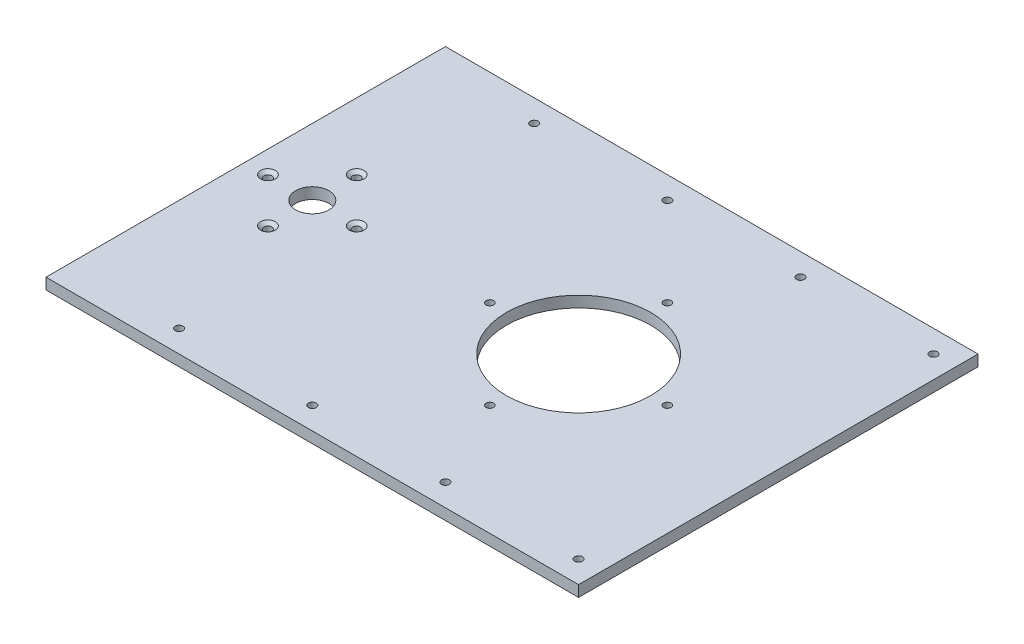
ISO-10303-21;
HEADER;
FILE_DESCRIPTION(('STEP AP214'),'2;1');
FILE_NAME('part.step','',(''),(''),'','','');
FILE_SCHEMA(('AUTOMOTIVE_DESIGN { 1 0 10303 214 1 1 1 1 }'));
ENDSEC;
DATA;
#1=APPLICATION_CONTEXT('core data for automotive mechanical design processes');
#2=APPLICATION_PROTOCOL_DEFINITION('international standard','automotive_design',2000,#1);
#3=PRODUCT_CONTEXT('',#1,'mechanical');
#4=PRODUCT('Part','Part','',(#3));
#5=PRODUCT_RELATED_PRODUCT_CATEGORY('part','',(#4));
#6=PRODUCT_DEFINITION_FORMATION('','',#4);
#7=PRODUCT_DEFINITION_CONTEXT('part definition',#1,'design');
#8=PRODUCT_DEFINITION('design','',#6,#7);
#9=PRODUCT_DEFINITION_SHAPE('','',#8);
#10=(LENGTH_UNIT() NAMED_UNIT(*) SI_UNIT(.MILLI.,.METRE.));
#11=(NAMED_UNIT(*) PLANE_ANGLE_UNIT() SI_UNIT($,.RADIAN.));
#12=(NAMED_UNIT(*) SI_UNIT($,.STERADIAN.) SOLID_ANGLE_UNIT());
#13=UNCERTAINTY_MEASURE_WITH_UNIT(LENGTH_MEASURE(1.E-05),#10,'distance_accuracy_value','');
#14=(GEOMETRIC_REPRESENTATION_CONTEXT(3) GLOBAL_UNCERTAINTY_ASSIGNED_CONTEXT((#13)) GLOBAL_UNIT_ASSIGNED_CONTEXT((#10,
#11,#12)) REPRESENTATION_CONTEXT('',''));
#15=CARTESIAN_POINT('',(0.,0.,0.));
#16=DIRECTION('',(0.,0.,1.));
#17=DIRECTION('',(1.,0.,0.));
#18=AXIS2_PLACEMENT_3D('',#15,#16,#17);
#19=CARTESIAN_POINT('',(0.,6.35,0.));
#20=DIRECTION('',(-1.,0.,0.));
#21=DIRECTION('',(0.,0.,1.));
#22=AXIS2_PLACEMENT_3D('',#19,#20,#21);
#23=PLANE('',#22);
#24=DIRECTION('',(0.,0.,-1.));
#25=VECTOR('',#24,1.);
#26=CARTESIAN_POINT('',(0.,0.,0.));
#27=LINE('',#26,#25);
#28=CARTESIAN_POINT('',(0.,0.,0.));
#29=VERTEX_POINT('',#28);
#30=CARTESIAN_POINT('',(0.,0.,-228.6));
#31=VERTEX_POINT('',#30);
#32=EDGE_CURVE('E104',#29,#31,#27,.T.);
#33=ORIENTED_EDGE('',*,*,#32,.T.);
#34=DIRECTION('',(0.,-1.,0.));
#35=VECTOR('',#34,1.);
#36=CARTESIAN_POINT('',(0.,6.35,-228.6));
#37=LINE('',#36,#35);
#38=CARTESIAN_POINT('',(0.,6.35,-228.6));
#39=VERTEX_POINT('',#38);
#40=EDGE_CURVE('E95',#39,#31,#37,.T.);
#41=ORIENTED_EDGE('',*,*,#40,.F.);
#42=DIRECTION('',(0.,0.,-1.));
#43=VECTOR('',#42,1.);
#44=CARTESIAN_POINT('',(0.,6.35,0.));
#45=LINE('',#44,#43);
#46=CARTESIAN_POINT('',(0.,6.35,0.));
#47=VERTEX_POINT('',#46);
#48=EDGE_CURVE('E89',#47,#39,#45,.T.);
#49=ORIENTED_EDGE('',*,*,#48,.F.);
#50=DIRECTION('',(0.,-1.,0.));
#51=VECTOR('',#50,1.);
#52=CARTESIAN_POINT('',(0.,6.35,0.));
#53=LINE('',#52,#51);
#54=EDGE_CURVE('E100',#47,#29,#53,.T.);
#55=ORIENTED_EDGE('',*,*,#54,.T.);
#56=EDGE_LOOP('',(#33,#41,#49,#55));
#57=FACE_BOUND('',#56,.T.);
#58=ADVANCED_FACE('F35',(#57),#23,.F.);
#59=CARTESIAN_POINT('',(0.,6.35,-228.6));
#60=DIRECTION('',(0.,0.,1.));
#61=DIRECTION('',(1.,0.,0.));
#62=AXIS2_PLACEMENT_3D('',#59,#60,#61);
#63=PLANE('',#62);
#64=DIRECTION('',(-1.,0.,0.));
#65=VECTOR('',#64,1.);
#66=CARTESIAN_POINT('',(0.,0.,-228.6));
#67=LINE('',#66,#65);
#68=CARTESIAN_POINT('',(-304.8,0.,-228.6));
#69=VERTEX_POINT('',#68);
#70=EDGE_CURVE('E94',#31,#69,#67,.T.);
#71=ORIENTED_EDGE('',*,*,#70,.T.);
#72=DIRECTION('',(0.,-1.,0.));
#73=VECTOR('',#72,1.);
#74=CARTESIAN_POINT('',(-304.8,6.35,-228.6));
#75=LINE('',#74,#73);
#76=CARTESIAN_POINT('',(-304.8,6.35,-228.6));
#77=VERTEX_POINT('',#76);
#78=EDGE_CURVE('E92',#77,#69,#75,.T.);
#79=ORIENTED_EDGE('',*,*,#78,.F.);
#80=DIRECTION('',(-1.,0.,0.));
#81=VECTOR('',#80,1.);
#82=CARTESIAN_POINT('',(0.,6.35,-228.6));
#83=LINE('',#82,#81);
#84=EDGE_CURVE('E83',#39,#77,#83,.T.);
#85=ORIENTED_EDGE('',*,*,#84,.F.);
#86=ORIENTED_EDGE('',*,*,#40,.T.);
#87=EDGE_LOOP('',(#71,#79,#85,#86));
#88=FACE_BOUND('',#87,.T.);
#89=ADVANCED_FACE('F93',(#88),#63,.F.);
#90=CARTESIAN_POINT('',(-304.8,6.35,0.));
#91=DIRECTION('',(1.,0.,0.));
#92=DIRECTION('',(0.,0.,-1.));
#93=AXIS2_PLACEMENT_3D('',#90,#91,#92);
#94=PLANE('',#93);
#95=DIRECTION('',(0.,0.,1.));
#96=VECTOR('',#95,1.);
#97=CARTESIAN_POINT('',(-304.8,0.,0.));
#98=LINE('',#97,#96);
#99=CARTESIAN_POINT('',(-304.8,0.,0.));
#100=VERTEX_POINT('',#99);
#101=EDGE_CURVE('E69',#69,#100,#98,.T.);
#102=ORIENTED_EDGE('',*,*,#101,.T.);
#103=DIRECTION('',(0.,-1.,0.));
#104=VECTOR('',#103,1.);
#105=CARTESIAN_POINT('',(-304.8,6.35,0.));
#106=LINE('',#105,#104);
#107=CARTESIAN_POINT('',(-304.8,6.35,0.));
#108=VERTEX_POINT('',#107);
#109=EDGE_CURVE('E96',#108,#100,#106,.T.);
#110=ORIENTED_EDGE('',*,*,#109,.F.);
#111=DIRECTION('',(0.,0.,1.));
#112=VECTOR('',#111,1.);
#113=CARTESIAN_POINT('',(-304.8,6.35,0.));
#114=LINE('',#113,#112);
#115=EDGE_CURVE('E87',#77,#108,#114,.T.);
#116=ORIENTED_EDGE('',*,*,#115,.F.);
#117=ORIENTED_EDGE('',*,*,#78,.T.);
#118=EDGE_LOOP('',(#102,#110,#116,#117));
#119=FACE_BOUND('',#118,.T.);
#120=ADVANCED_FACE('F98',(#119),#94,.F.);
#121=CARTESIAN_POINT('',(0.,6.35,0.));
#122=DIRECTION('',(0.,0.,-1.));
#123=DIRECTION('',(-1.,0.,0.));
#124=AXIS2_PLACEMENT_3D('',#121,#122,#123);
#125=PLANE('',#124);
#126=DIRECTION('',(1.,0.,0.));
#127=VECTOR('',#126,1.);
#128=CARTESIAN_POINT('',(0.,0.,0.));
#129=LINE('',#128,#127);
#130=EDGE_CURVE('E75',#100,#29,#129,.T.);
#131=ORIENTED_EDGE('',*,*,#130,.T.);
#132=ORIENTED_EDGE('',*,*,#54,.F.);
#133=DIRECTION('',(1.,0.,0.));
#134=VECTOR('',#133,1.);
#135=CARTESIAN_POINT('',(0.,6.35,0.));
#136=LINE('',#135,#134);
#137=EDGE_CURVE('E52',#108,#47,#136,.T.);
#138=ORIENTED_EDGE('',*,*,#137,.F.);
#139=ORIENTED_EDGE('',*,*,#109,.T.);
#140=EDGE_LOOP('',(#131,#132,#138,#139));
#141=FACE_BOUND('',#140,.T.);
#142=ADVANCED_FACE('F171',(#141),#125,.F.);
#143=CARTESIAN_POINT('',(0.,6.35,-228.6));
#144=DIRECTION('',(0.,1.,0.));
#145=DIRECTION('',(0.,0.,1.));
#146=AXIS2_PLACEMENT_3D('',#143,#144,#145);
#147=PLANE('',#146);
#148=CARTESIAN_POINT('',(-266.7,6.35,-139.7));
#149=DIRECTION('',(0.,1.,0.));
#150=DIRECTION('',(0.,0.,1.));
#151=AXIS2_PLACEMENT_3D('',#148,#149,#150);
#152=CIRCLE('',#151,4.21640000000001);
#153=CARTESIAN_POINT('',(-266.7,6.35,-135.4836));
#154=VERTEX_POINT('',#153);
#155=EDGE_CURVE('E405',#154,#154,#152,.T.);
#156=ORIENTED_EDGE('',*,*,#155,.F.);
#157=EDGE_LOOP('',(#156));
#158=FACE_BOUND('',#157,.T.);
#159=CARTESIAN_POINT('',(-241.3,6.35,-114.3));
#160=DIRECTION('',(0.,1.,0.));
#161=DIRECTION('',(0.,0.,1.));
#162=AXIS2_PLACEMENT_3D('',#159,#160,#161);
#163=CIRCLE('',#162,4.21640000000001);
#164=CARTESIAN_POINT('',(-241.3,6.35,-110.0836));
#165=VERTEX_POINT('',#164);
#166=EDGE_CURVE('E397',#165,#165,#163,.T.);
#167=ORIENTED_EDGE('',*,*,#166,.F.);
#168=EDGE_LOOP('',(#167));
#169=FACE_BOUND('',#168,.T.);
#170=CARTESIAN_POINT('',(-266.7,6.35,-88.9));
#171=DIRECTION('',(0.,1.,0.));
#172=DIRECTION('',(0.,0.,1.));
#173=AXIS2_PLACEMENT_3D('',#170,#171,#172);
#174=CIRCLE('',#173,4.21640000000001);
#175=CARTESIAN_POINT('',(-266.7,6.35,-84.6836));
#176=VERTEX_POINT('',#175);
#177=EDGE_CURVE('E388',#176,#176,#174,.T.);
#178=ORIENTED_EDGE('',*,*,#177,.F.);
#179=EDGE_LOOP('',(#178));
#180=FACE_BOUND('',#179,.T.);
#181=CARTESIAN_POINT('',(-292.1,6.35,-114.3));
#182=DIRECTION('',(0.,1.,0.));
#183=DIRECTION('',(0.,0.,1.));
#184=AXIS2_PLACEMENT_3D('',#181,#182,#183);
#185=CIRCLE('',#184,4.21640000000001);
#186=CARTESIAN_POINT('',(-292.1,6.35,-110.0836));
#187=VERTEX_POINT('',#186);
#188=EDGE_CURVE('E379',#187,#187,#185,.T.);
#189=ORIENTED_EDGE('',*,*,#188,.F.);
#190=EDGE_LOOP('',(#189));
#191=FACE_BOUND('',#190,.T.);
#192=CARTESIAN_POINT('',(-266.7,6.35,-114.3));
#193=DIRECTION('',(0.,1.,0.));
#194=DIRECTION('',(0.,0.,1.));
#195=AXIS2_PLACEMENT_3D('',#192,#193,#194);
#196=CIRCLE('',#195,9.52500000000002);
#197=CARTESIAN_POINT('',(-266.7,6.35,-104.775));
#198=VERTEX_POINT('',#197);
#199=EDGE_CURVE('E368',#198,#198,#196,.T.);
#200=ORIENTED_EDGE('',*,*,#199,.F.);
#201=EDGE_LOOP('',(#200));
#202=FACE_BOUND('',#201,.T.);
#203=CARTESIAN_POINT('',(-88.9,6.35,-215.9));
#204=DIRECTION('',(0.,-1.,0.));
#205=DIRECTION('',(0.,0.,-1.));
#206=AXIS2_PLACEMENT_3D('',#203,#204,#205);
#207=CIRCLE('',#206,2.2479);
#208=CARTESIAN_POINT('',(-88.9,6.35,-218.1479));
#209=VERTEX_POINT('',#208);
#210=EDGE_CURVE('E361',#209,#209,#207,.T.);
#211=ORIENTED_EDGE('',*,*,#210,.T.);
#212=EDGE_LOOP('',(#211));
#213=FACE_BOUND('',#212,.T.);
#214=CARTESIAN_POINT('',(-88.9,6.35,-12.7));
#215=DIRECTION('',(0.,-1.,0.));
#216=DIRECTION('',(0.,0.,-1.));
#217=AXIS2_PLACEMENT_3D('',#214,#215,#216);
#218=CIRCLE('',#217,2.2479);
#219=CARTESIAN_POINT('',(-88.9,6.35,-14.9479));
#220=VERTEX_POINT('',#219);
#221=EDGE_CURVE('E352',#220,#220,#218,.T.);
#222=ORIENTED_EDGE('',*,*,#221,.T.);
#223=EDGE_LOOP('',(#222));
#224=FACE_BOUND('',#223,.T.);
#225=CARTESIAN_POINT('',(-12.7,6.35,-12.7));
#226=DIRECTION('',(0.,-1.,0.));
#227=DIRECTION('',(0.,0.,-1.));
#228=AXIS2_PLACEMENT_3D('',#225,#226,#227);
#229=CIRCLE('',#228,2.2479);
#230=CARTESIAN_POINT('',(-12.7,6.35,-14.9479));
#231=VERTEX_POINT('',#230);
#232=EDGE_CURVE('E340',#231,#231,#229,.T.);
#233=ORIENTED_EDGE('',*,*,#232,.T.);
#234=EDGE_LOOP('',(#233));
#235=FACE_BOUND('',#234,.T.);
#236=CARTESIAN_POINT('',(-12.7,6.35,-215.9));
#237=DIRECTION('',(0.,-1.,0.));
#238=DIRECTION('',(0.,0.,-1.));
#239=AXIS2_PLACEMENT_3D('',#236,#237,#238);
#240=CIRCLE('',#239,2.2479);
#241=CARTESIAN_POINT('',(-12.7,6.35,-218.1479));
#242=VERTEX_POINT('',#241);
#243=EDGE_CURVE('E329',#242,#242,#240,.T.);
#244=ORIENTED_EDGE('',*,*,#243,.T.);
#245=EDGE_LOOP('',(#244));
#246=FACE_BOUND('',#245,.T.);
#247=CARTESIAN_POINT('',(-114.3,6.35,-114.3));
#248=DIRECTION('',(0.,1.,0.));
#249=DIRECTION('',(0.,0.,1.));
#250=AXIS2_PLACEMENT_3D('',#247,#248,#249);
#251=CIRCLE('',#250,41.275);
#252=CARTESIAN_POINT('',(-114.3,6.35,-73.025));
#253=VERTEX_POINT('',#252);
#254=EDGE_CURVE('E326',#253,#253,#251,.T.);
#255=ORIENTED_EDGE('',*,*,#254,.F.);
#256=EDGE_LOOP('',(#255));
#257=FACE_BOUND('',#256,.T.);
#258=CARTESIAN_POINT('',(-63.5,6.35,-114.299999999999));
#259=DIRECTION('',(0.,-1.,0.));
#260=DIRECTION('',(0.,0.,-1.));
#261=AXIS2_PLACEMENT_3D('',#258,#259,#260);
#262=CIRCLE('',#261,2.15265);
#263=CARTESIAN_POINT('',(-63.5,6.35,-116.452649999999));
#264=VERTEX_POINT('',#263);
#265=EDGE_CURVE('E316',#264,#264,#262,.T.);
#266=ORIENTED_EDGE('',*,*,#265,.T.);
#267=EDGE_LOOP('',(#266));
#268=FACE_BOUND('',#267,.T.);
#269=CARTESIAN_POINT('',(-114.3,6.35,-165.1));
#270=DIRECTION('',(0.,-1.,0.));
#271=DIRECTION('',(0.,0.,-1.));
#272=AXIS2_PLACEMENT_3D('',#269,#270,#271);
#273=CIRCLE('',#272,2.15264999999999);
#274=CARTESIAN_POINT('',(-114.3,6.35,-167.25265));
#275=VERTEX_POINT('',#274);
#276=EDGE_CURVE('E307',#275,#275,#273,.T.);
#277=ORIENTED_EDGE('',*,*,#276,.T.);
#278=EDGE_LOOP('',(#277));
#279=FACE_BOUND('',#278,.T.);
#280=CARTESIAN_POINT('',(-165.1,6.35,-114.3));
#281=DIRECTION('',(0.,-1.,0.));
#282=DIRECTION('',(0.,0.,-1.));
#283=AXIS2_PLACEMENT_3D('',#280,#281,#282);
#284=CIRCLE('',#283,2.15265000000001);
#285=CARTESIAN_POINT('',(-165.1,6.35,-116.45265));
#286=VERTEX_POINT('',#285);
#287=EDGE_CURVE('E290',#286,#286,#284,.T.);
#288=ORIENTED_EDGE('',*,*,#287,.T.);
#289=EDGE_LOOP('',(#288));
#290=FACE_BOUND('',#289,.T.);
#291=CARTESIAN_POINT('',(-114.3,6.35,-63.5));
#292=DIRECTION('',(0.,-1.,0.));
#293=DIRECTION('',(0.,0.,-1.));
#294=AXIS2_PLACEMENT_3D('',#291,#292,#293);
#295=CIRCLE('',#294,2.15264999999999);
#296=CARTESIAN_POINT('',(-114.3,6.35,-65.65265));
#297=VERTEX_POINT('',#296);
#298=EDGE_CURVE('E107',#297,#297,#295,.T.);
#299=ORIENTED_EDGE('',*,*,#298,.T.);
#300=EDGE_LOOP('',(#299));
#301=FACE_BOUND('',#300,.T.);
#302=ORIENTED_EDGE('',*,*,#48,.T.);
#303=ORIENTED_EDGE('',*,*,#84,.T.);
#304=ORIENTED_EDGE('',*,*,#115,.T.);
#305=ORIENTED_EDGE('',*,*,#137,.T.);
#306=EDGE_LOOP('',(#302,#303,#304,#305));
#307=FACE_BOUND('',#306,.T.);
#308=CARTESIAN_POINT('',(-165.1,6.35,-12.6999999999999));
#309=DIRECTION('',(0.,-1.,0.));
#310=DIRECTION('',(0.,0.,-1.));
#311=AXIS2_PLACEMENT_3D('',#308,#309,#310);
#312=CIRCLE('',#311,2.2479);
#313=CARTESIAN_POINT('',(-165.1,6.35,-14.9478999999999));
#314=VERTEX_POINT('',#313);
#315=EDGE_CURVE('E117',#314,#314,#312,.T.);
#316=ORIENTED_EDGE('',*,*,#315,.T.);
#317=EDGE_LOOP('',(#316));
#318=FACE_BOUND('',#317,.T.);
#319=CARTESIAN_POINT('',(-241.3,6.35,-12.6999999999999));
#320=DIRECTION('',(0.,-1.,0.));
#321=DIRECTION('',(0.,0.,-1.));
#322=AXIS2_PLACEMENT_3D('',#319,#320,#321);
#323=CIRCLE('',#322,2.2479);
#324=CARTESIAN_POINT('',(-241.3,6.35,-14.9478999999999));
#325=VERTEX_POINT('',#324);
#326=EDGE_CURVE('E126',#325,#325,#323,.T.);
#327=ORIENTED_EDGE('',*,*,#326,.T.);
#328=EDGE_LOOP('',(#327));
#329=FACE_BOUND('',#328,.T.);
#330=CARTESIAN_POINT('',(-165.1,6.35,-215.9));
#331=DIRECTION('',(0.,-1.,0.));
#332=DIRECTION('',(0.,0.,-1.));
#333=AXIS2_PLACEMENT_3D('',#330,#331,#332);
#334=CIRCLE('',#333,2.2479);
#335=CARTESIAN_POINT('',(-165.1,6.35,-218.1479));
#336=VERTEX_POINT('',#335);
#337=EDGE_CURVE('E135',#336,#336,#334,.T.);
#338=ORIENTED_EDGE('',*,*,#337,.T.);
#339=EDGE_LOOP('',(#338));
#340=FACE_BOUND('',#339,.T.);
#341=CARTESIAN_POINT('',(-241.3,6.35,-215.9));
#342=DIRECTION('',(0.,-1.,0.));
#343=DIRECTION('',(0.,0.,-1.));
#344=AXIS2_PLACEMENT_3D('',#341,#342,#343);
#345=CIRCLE('',#344,2.2479);
#346=CARTESIAN_POINT('',(-241.3,6.35,-218.1479));
#347=VERTEX_POINT('',#346);
#348=EDGE_CURVE('E44',#347,#347,#345,.T.);
#349=ORIENTED_EDGE('',*,*,#348,.T.);
#350=EDGE_LOOP('',(#349));
#351=FACE_BOUND('',#350,.T.);
#352=ADVANCED_FACE('F84',(#158,#169,#180,#191,#202,#213,#224,#235,#246,#257,#268,#279,#290,#301,
#307,#318,#329,#340,#351),#147,.T.);
#353=CARTESIAN_POINT('',(0.,0.,-228.6));
#354=DIRECTION('',(0.,1.,0.));
#355=DIRECTION('',(0.,0.,1.));
#356=AXIS2_PLACEMENT_3D('',#353,#354,#355);
#357=PLANE('',#356);
#358=CARTESIAN_POINT('',(-266.7,0.,-139.7));
#359=DIRECTION('',(0.,1.,0.));
#360=DIRECTION('',(0.,0.,1.));
#361=AXIS2_PLACEMENT_3D('',#358,#359,#360);
#362=CIRCLE('',#361,2.24790000000002);
#363=CARTESIAN_POINT('',(-266.7,0.,-137.4521));
#364=VERTEX_POINT('',#363);
#365=EDGE_CURVE('E400',#364,#364,#362,.T.);
#366=ORIENTED_EDGE('',*,*,#365,.T.);
#367=EDGE_LOOP('',(#366));
#368=FACE_BOUND('',#367,.T.);
#369=CARTESIAN_POINT('',(-241.3,0.,-114.3));
#370=DIRECTION('',(0.,1.,0.));
#371=DIRECTION('',(0.,0.,1.));
#372=AXIS2_PLACEMENT_3D('',#369,#370,#371);
#373=CIRCLE('',#372,2.2479);
#374=CARTESIAN_POINT('',(-241.3,0.,-112.0521));
#375=VERTEX_POINT('',#374);
#376=EDGE_CURVE('E391',#375,#375,#373,.T.);
#377=ORIENTED_EDGE('',*,*,#376,.T.);
#378=EDGE_LOOP('',(#377));
#379=FACE_BOUND('',#378,.T.);
#380=CARTESIAN_POINT('',(-266.7,0.,-88.9));
#381=DIRECTION('',(0.,1.,0.));
#382=DIRECTION('',(0.,0.,1.));
#383=AXIS2_PLACEMENT_3D('',#380,#381,#382);
#384=CIRCLE('',#383,2.24790000000002);
#385=CARTESIAN_POINT('',(-266.7,0.,-86.6520999999999));
#386=VERTEX_POINT('',#385);
#387=EDGE_CURVE('E382',#386,#386,#384,.T.);
#388=ORIENTED_EDGE('',*,*,#387,.T.);
#389=EDGE_LOOP('',(#388));
#390=FACE_BOUND('',#389,.T.);
#391=CARTESIAN_POINT('',(-292.1,0.,-114.3));
#392=DIRECTION('',(0.,1.,0.));
#393=DIRECTION('',(0.,0.,1.));
#394=AXIS2_PLACEMENT_3D('',#391,#392,#393);
#395=CIRCLE('',#394,2.24790000000002);
#396=CARTESIAN_POINT('',(-292.1,0.,-112.0521));
#397=VERTEX_POINT('',#396);
#398=EDGE_CURVE('E371',#397,#397,#395,.T.);
#399=ORIENTED_EDGE('',*,*,#398,.T.);
#400=EDGE_LOOP('',(#399));
#401=FACE_BOUND('',#400,.T.);
#402=CARTESIAN_POINT('',(-266.7,0.,-114.3));
#403=DIRECTION('',(0.,1.,0.));
#404=DIRECTION('',(0.,0.,1.));
#405=AXIS2_PLACEMENT_3D('',#402,#403,#404);
#406=CIRCLE('',#405,9.52500000000002);
#407=CARTESIAN_POINT('',(-266.7,0.,-104.775));
#408=VERTEX_POINT('',#407);
#409=EDGE_CURVE('E367',#408,#408,#406,.T.);
#410=ORIENTED_EDGE('',*,*,#409,.T.);
#411=EDGE_LOOP('',(#410));
#412=FACE_BOUND('',#411,.T.);
#413=CARTESIAN_POINT('',(-88.9,0.,-215.9));
#414=DIRECTION('',(0.,-1.,0.));
#415=DIRECTION('',(0.,0.,-1.));
#416=AXIS2_PLACEMENT_3D('',#413,#414,#415);
#417=CIRCLE('',#416,4.2164);
#418=CARTESIAN_POINT('',(-88.9,0.,-220.1164));
#419=VERTEX_POINT('',#418);
#420=EDGE_CURVE('E364',#419,#419,#417,.T.);
#421=ORIENTED_EDGE('',*,*,#420,.F.);
#422=EDGE_LOOP('',(#421));
#423=FACE_BOUND('',#422,.T.);
#424=CARTESIAN_POINT('',(-88.9,0.,-12.7));
#425=DIRECTION('',(0.,-1.,0.));
#426=DIRECTION('',(0.,0.,-1.));
#427=AXIS2_PLACEMENT_3D('',#424,#425,#426);
#428=CIRCLE('',#427,4.2164);
#429=CARTESIAN_POINT('',(-88.9,0.,-16.9164));
#430=VERTEX_POINT('',#429);
#431=EDGE_CURVE('E355',#430,#430,#428,.T.);
#432=ORIENTED_EDGE('',*,*,#431,.F.);
#433=EDGE_LOOP('',(#432));
#434=FACE_BOUND('',#433,.T.);
#435=CARTESIAN_POINT('',(-12.7,0.,-12.7));
#436=DIRECTION('',(0.,-1.,0.));
#437=DIRECTION('',(0.,0.,-1.));
#438=AXIS2_PLACEMENT_3D('',#435,#436,#437);
#439=CIRCLE('',#438,4.2164);
#440=CARTESIAN_POINT('',(-12.7,0.,-16.9164));
#441=VERTEX_POINT('',#440);
#442=EDGE_CURVE('E346',#441,#441,#439,.T.);
#443=ORIENTED_EDGE('',*,*,#442,.F.);
#444=EDGE_LOOP('',(#443));
#445=FACE_BOUND('',#444,.T.);
#446=CARTESIAN_POINT('',(-12.7,0.,-215.9));
#447=DIRECTION('',(0.,-1.,0.));
#448=DIRECTION('',(0.,0.,-1.));
#449=AXIS2_PLACEMENT_3D('',#446,#447,#448);
#450=CIRCLE('',#449,4.2164);
#451=CARTESIAN_POINT('',(-12.7,0.,-220.1164));
#452=VERTEX_POINT('',#451);
#453=EDGE_CURVE('E337',#452,#452,#450,.T.);
#454=ORIENTED_EDGE('',*,*,#453,.F.);
#455=EDGE_LOOP('',(#454));
#456=FACE_BOUND('',#455,.T.);
#457=CARTESIAN_POINT('',(-114.3,0.,-114.3));
#458=DIRECTION('',(0.,1.,0.));
#459=DIRECTION('',(0.,0.,1.));
#460=AXIS2_PLACEMENT_3D('',#457,#458,#459);
#461=CIRCLE('',#460,41.275);
#462=CARTESIAN_POINT('',(-114.3,0.,-73.025));
#463=VERTEX_POINT('',#462);
#464=EDGE_CURVE('E325',#463,#463,#461,.T.);
#465=ORIENTED_EDGE('',*,*,#464,.T.);
#466=EDGE_LOOP('',(#465));
#467=FACE_BOUND('',#466,.T.);
#468=CARTESIAN_POINT('',(-63.5,0.,-114.299999999999));
#469=DIRECTION('',(0.,-1.,0.));
#470=DIRECTION('',(0.,0.,-1.));
#471=AXIS2_PLACEMENT_3D('',#468,#469,#470);
#472=CIRCLE('',#471,4.2164);
#473=CARTESIAN_POINT('',(-63.5,0.,-118.516399999999));
#474=VERTEX_POINT('',#473);
#475=EDGE_CURVE('E322',#474,#474,#472,.T.);
#476=ORIENTED_EDGE('',*,*,#475,.F.);
#477=EDGE_LOOP('',(#476));
#478=FACE_BOUND('',#477,.T.);
#479=CARTESIAN_POINT('',(-114.3,0.,-165.1));
#480=DIRECTION('',(0.,-1.,0.));
#481=DIRECTION('',(0.,0.,-1.));
#482=AXIS2_PLACEMENT_3D('',#479,#480,#481);
#483=CIRCLE('',#482,4.21639999999999);
#484=CARTESIAN_POINT('',(-114.3,0.,-169.3164));
#485=VERTEX_POINT('',#484);
#486=EDGE_CURVE('E313',#485,#485,#483,.T.);
#487=ORIENTED_EDGE('',*,*,#486,.F.);
#488=EDGE_LOOP('',(#487));
#489=FACE_BOUND('',#488,.T.);
#490=CARTESIAN_POINT('',(-165.1,0.,-114.3));
#491=DIRECTION('',(0.,-1.,0.));
#492=DIRECTION('',(0.,0.,-1.));
#493=AXIS2_PLACEMENT_3D('',#490,#491,#492);
#494=CIRCLE('',#493,4.21640000000001);
#495=CARTESIAN_POINT('',(-165.1,0.,-118.5164));
#496=VERTEX_POINT('',#495);
#497=EDGE_CURVE('E304',#496,#496,#494,.T.);
#498=ORIENTED_EDGE('',*,*,#497,.F.);
#499=EDGE_LOOP('',(#498));
#500=FACE_BOUND('',#499,.T.);
#501=CARTESIAN_POINT('',(-114.3,0.,-63.5));
#502=DIRECTION('',(0.,-1.,0.));
#503=DIRECTION('',(0.,0.,-1.));
#504=AXIS2_PLACEMENT_3D('',#501,#502,#503);
#505=CIRCLE('',#504,4.21639999999999);
#506=CARTESIAN_POINT('',(-114.3,0.,-67.7164));
#507=VERTEX_POINT('',#506);
#508=EDGE_CURVE('E288',#507,#507,#505,.T.);
#509=ORIENTED_EDGE('',*,*,#508,.F.);
#510=EDGE_LOOP('',(#509));
#511=FACE_BOUND('',#510,.T.);
#512=ORIENTED_EDGE('',*,*,#32,.F.);
#513=ORIENTED_EDGE('',*,*,#130,.F.);
#514=ORIENTED_EDGE('',*,*,#101,.F.);
#515=ORIENTED_EDGE('',*,*,#70,.F.);
#516=EDGE_LOOP('',(#512,#513,#514,#515));
#517=FACE_BOUND('',#516,.T.);
#518=CARTESIAN_POINT('',(-165.1,0.,-12.6999999999999));
#519=DIRECTION('',(0.,-1.,0.));
#520=DIRECTION('',(0.,0.,-1.));
#521=AXIS2_PLACEMENT_3D('',#518,#519,#520);
#522=CIRCLE('',#521,4.2164);
#523=CARTESIAN_POINT('',(-165.1,0.,-16.9163999999999));
#524=VERTEX_POINT('',#523);
#525=EDGE_CURVE('E114',#524,#524,#522,.T.);
#526=ORIENTED_EDGE('',*,*,#525,.F.);
#527=EDGE_LOOP('',(#526));
#528=FACE_BOUND('',#527,.T.);
#529=CARTESIAN_POINT('',(-241.3,0.,-12.6999999999999));
#530=DIRECTION('',(0.,-1.,0.));
#531=DIRECTION('',(0.,0.,-1.));
#532=AXIS2_PLACEMENT_3D('',#529,#530,#531);
#533=CIRCLE('',#532,4.2164);
#534=CARTESIAN_POINT('',(-241.3,0.,-16.9163999999999));
#535=VERTEX_POINT('',#534);
#536=EDGE_CURVE('E123',#535,#535,#533,.T.);
#537=ORIENTED_EDGE('',*,*,#536,.F.);
#538=EDGE_LOOP('',(#537));
#539=FACE_BOUND('',#538,.T.);
#540=CARTESIAN_POINT('',(-165.1,0.,-215.9));
#541=DIRECTION('',(0.,-1.,0.));
#542=DIRECTION('',(0.,0.,-1.));
#543=AXIS2_PLACEMENT_3D('',#540,#541,#542);
#544=CIRCLE('',#543,4.2164);
#545=CARTESIAN_POINT('',(-165.1,0.,-220.1164));
#546=VERTEX_POINT('',#545);
#547=EDGE_CURVE('E132',#546,#546,#544,.T.);
#548=ORIENTED_EDGE('',*,*,#547,.F.);
#549=EDGE_LOOP('',(#548));
#550=FACE_BOUND('',#549,.T.);
#551=CARTESIAN_POINT('',(-241.3,0.,-215.9));
#552=DIRECTION('',(0.,-1.,0.));
#553=DIRECTION('',(0.,0.,-1.));
#554=AXIS2_PLACEMENT_3D('',#551,#552,#553);
#555=CIRCLE('',#554,4.2164);
#556=CARTESIAN_POINT('',(-241.3,0.,-220.1164));
#557=VERTEX_POINT('',#556);
#558=EDGE_CURVE('E141',#557,#557,#555,.T.);
#559=ORIENTED_EDGE('',*,*,#558,.F.);
#560=EDGE_LOOP('',(#559));
#561=FACE_BOUND('',#560,.T.);
#562=ADVANCED_FACE('F158',(#368,#379,#390,#401,#412,#423,#434,#445,#456,#467,#478,#489,#500,
#511,#517,#528,#539,#550,#561),#357,.F.);
#563=CARTESIAN_POINT('',(-114.3,0.,-63.5));
#564=DIRECTION('',(0.,-1.,0.));
#565=DIRECTION('',(0.,0.,-1.));
#566=AXIS2_PLACEMENT_3D('',#563,#564,#565);
#567=CYLINDRICAL_SURFACE('',#566,2.15264999999999);
#568=ORIENTED_EDGE('',*,*,#298,.F.);
#569=EDGE_LOOP('',(#568));
#570=FACE_BOUND('',#569,.T.);
#571=CARTESIAN_POINT('',(-114.3,1.7316918638421,-63.5));
#572=DIRECTION('',(0.,-1.,0.));
#573=DIRECTION('',(0.,0.,-1.));
#574=AXIS2_PLACEMENT_3D('',#571,#572,#573);
#575=CIRCLE('',#574,2.15264999999999);
#576=CARTESIAN_POINT('',(-114.3,1.7316918638421,-65.65265));
#577=VERTEX_POINT('',#576);
#578=EDGE_CURVE('E285',#577,#577,#575,.T.);
#579=ORIENTED_EDGE('',*,*,#578,.T.);
#580=EDGE_LOOP('',(#579));
#581=FACE_BOUND('',#580,.T.);
#582=ADVANCED_FACE('F160',(#570,#581),#567,.F.);
#583=CARTESIAN_POINT('',(-114.3,0.,-63.5));
#584=DIRECTION('',(0.,-1.,0.));
#585=DIRECTION('',(0.,0.,-1.));
#586=AXIS2_PLACEMENT_3D('',#583,#584,#585);
#587=CONICAL_SURFACE('',#586,4.21639999999999,0.872664625997168);
#588=ORIENTED_EDGE('',*,*,#578,.F.);
#589=EDGE_LOOP('',(#588));
#590=FACE_BOUND('',#589,.T.);
#591=ORIENTED_EDGE('',*,*,#508,.T.);
#592=EDGE_LOOP('',(#591));
#593=FACE_BOUND('',#592,.T.);
#594=ADVANCED_FACE('F168',(#590,#593),#587,.F.);
#595=CARTESIAN_POINT('',(-165.1,0.,-114.3));
#596=DIRECTION('',(0.,-1.,0.));
#597=DIRECTION('',(0.,0.,-1.));
#598=AXIS2_PLACEMENT_3D('',#595,#596,#597);
#599=CYLINDRICAL_SURFACE('',#598,2.15264999999999);
#600=ORIENTED_EDGE('',*,*,#287,.F.);
#601=EDGE_LOOP('',(#600));
#602=FACE_BOUND('',#601,.T.);
#603=CARTESIAN_POINT('',(-165.1,1.7316918638421,-114.3));
#604=DIRECTION('',(0.,-1.,0.));
#605=DIRECTION('',(0.,0.,-1.));
#606=AXIS2_PLACEMENT_3D('',#603,#604,#605);
#607=CIRCLE('',#606,2.15264999999998);
#608=CARTESIAN_POINT('',(-165.1,1.7316918638421,-116.45265));
#609=VERTEX_POINT('',#608);
#610=EDGE_CURVE('E294',#609,#609,#607,.T.);
#611=ORIENTED_EDGE('',*,*,#610,.T.);
#612=EDGE_LOOP('',(#611));
#613=FACE_BOUND('',#612,.T.);
#614=ADVANCED_FACE('F273',(#602,#613),#599,.F.);
#615=CARTESIAN_POINT('',(-165.1,0.,-114.3));
#616=DIRECTION('',(0.,-1.,0.));
#617=DIRECTION('',(0.,0.,-1.));
#618=AXIS2_PLACEMENT_3D('',#615,#616,#617);
#619=CONICAL_SURFACE('',#618,4.21640000000001,0.872664625997174);
#620=ORIENTED_EDGE('',*,*,#610,.F.);
#621=EDGE_LOOP('',(#620));
#622=FACE_BOUND('',#621,.T.);
#623=ORIENTED_EDGE('',*,*,#497,.T.);
#624=EDGE_LOOP('',(#623));
#625=FACE_BOUND('',#624,.T.);
#626=ADVANCED_FACE('F269',(#622,#625),#619,.F.);
#627=CARTESIAN_POINT('',(-114.3,0.,-165.1));
#628=DIRECTION('',(0.,-1.,0.));
#629=DIRECTION('',(0.,0.,-1.));
#630=AXIS2_PLACEMENT_3D('',#627,#628,#629);
#631=CYLINDRICAL_SURFACE('',#630,2.15264999999999);
#632=ORIENTED_EDGE('',*,*,#276,.F.);
#633=EDGE_LOOP('',(#632));
#634=FACE_BOUND('',#633,.T.);
#635=CARTESIAN_POINT('',(-114.3,1.7316918638421,-165.1));
#636=DIRECTION('',(0.,-1.,0.));
#637=DIRECTION('',(0.,0.,-1.));
#638=AXIS2_PLACEMENT_3D('',#635,#636,#637);
#639=CIRCLE('',#638,2.15264999999999);
#640=CARTESIAN_POINT('',(-114.3,1.7316918638421,-167.25265));
#641=VERTEX_POINT('',#640);
#642=EDGE_CURVE('E310',#641,#641,#639,.T.);
#643=ORIENTED_EDGE('',*,*,#642,.T.);
#644=EDGE_LOOP('',(#643));
#645=FACE_BOUND('',#644,.T.);
#646=ADVANCED_FACE('F265',(#634,#645),#631,.F.);
#647=CARTESIAN_POINT('',(-114.3,0.,-165.1));
#648=DIRECTION('',(0.,-1.,0.));
#649=DIRECTION('',(0.,0.,-1.));
#650=AXIS2_PLACEMENT_3D('',#647,#648,#649);
#651=CONICAL_SURFACE('',#650,4.21639999999999,0.872664625997168);
#652=ORIENTED_EDGE('',*,*,#642,.F.);
#653=EDGE_LOOP('',(#652));
#654=FACE_BOUND('',#653,.T.);
#655=ORIENTED_EDGE('',*,*,#486,.T.);
#656=EDGE_LOOP('',(#655));
#657=FACE_BOUND('',#656,.T.);
#658=ADVANCED_FACE('F261',(#654,#657),#651,.F.);
#659=CARTESIAN_POINT('',(-63.5,0.,-114.299999999999));
#660=DIRECTION('',(0.,-1.,0.));
#661=DIRECTION('',(0.,0.,-1.));
#662=AXIS2_PLACEMENT_3D('',#659,#660,#661);
#663=CYLINDRICAL_SURFACE('',#662,2.15265);
#664=ORIENTED_EDGE('',*,*,#265,.F.);
#665=EDGE_LOOP('',(#664));
#666=FACE_BOUND('',#665,.T.);
#667=CARTESIAN_POINT('',(-63.5,1.7316918638421,-114.299999999999));
#668=DIRECTION('',(0.,-1.,0.));
#669=DIRECTION('',(0.,0.,-1.));
#670=AXIS2_PLACEMENT_3D('',#667,#668,#669);
#671=CIRCLE('',#670,2.15264999999999);
#672=CARTESIAN_POINT('',(-63.5,1.7316918638421,-116.452649999999));
#673=VERTEX_POINT('',#672);
#674=EDGE_CURVE('E319',#673,#673,#671,.T.);
#675=ORIENTED_EDGE('',*,*,#674,.T.);
#676=EDGE_LOOP('',(#675));
#677=FACE_BOUND('',#676,.T.);
#678=ADVANCED_FACE('F257',(#666,#677),#663,.F.);
#679=CARTESIAN_POINT('',(-63.5,0.,-114.299999999999));
#680=DIRECTION('',(0.,-1.,0.));
#681=DIRECTION('',(0.,0.,-1.));
#682=AXIS2_PLACEMENT_3D('',#679,#680,#681);
#683=CONICAL_SURFACE('',#682,4.2164,0.872664625997169);
#684=ORIENTED_EDGE('',*,*,#674,.F.);
#685=EDGE_LOOP('',(#684));
#686=FACE_BOUND('',#685,.T.);
#687=ORIENTED_EDGE('',*,*,#475,.T.);
#688=EDGE_LOOP('',(#687));
#689=FACE_BOUND('',#688,.T.);
#690=ADVANCED_FACE('F253',(#686,#689),#683,.F.);
#691=CARTESIAN_POINT('',(-114.3,0.,-114.3));
#692=DIRECTION('',(0.,1.,0.));
#693=DIRECTION('',(0.,0.,1.));
#694=AXIS2_PLACEMENT_3D('',#691,#692,#693);
#695=CYLINDRICAL_SURFACE('',#694,41.275);
#696=ORIENTED_EDGE('',*,*,#464,.F.);
#697=EDGE_LOOP('',(#696));
#698=FACE_BOUND('',#697,.T.);
#699=ORIENTED_EDGE('',*,*,#254,.T.);
#700=EDGE_LOOP('',(#699));
#701=FACE_BOUND('',#700,.T.);
#702=ADVANCED_FACE('F249',(#698,#701),#695,.F.);
#703=CARTESIAN_POINT('',(-12.7,0.,-215.9));
#704=DIRECTION('',(0.,-1.,0.));
#705=DIRECTION('',(0.,0.,-1.));
#706=AXIS2_PLACEMENT_3D('',#703,#704,#705);
#707=CYLINDRICAL_SURFACE('',#706,2.2479);
#708=ORIENTED_EDGE('',*,*,#243,.F.);
#709=EDGE_LOOP('',(#708));
#710=FACE_BOUND('',#709,.T.);
#711=CARTESIAN_POINT('',(-12.7,1.65176762397248,-215.9));
#712=DIRECTION('',(0.,-1.,0.));
#713=DIRECTION('',(0.,0.,-1.));
#714=AXIS2_PLACEMENT_3D('',#711,#712,#713);
#715=CIRCLE('',#714,2.2479);
#716=CARTESIAN_POINT('',(-12.7,1.65176762397248,-218.1479));
#717=VERTEX_POINT('',#716);
#718=EDGE_CURVE('E334',#717,#717,#715,.T.);
#719=ORIENTED_EDGE('',*,*,#718,.T.);
#720=EDGE_LOOP('',(#719));
#721=FACE_BOUND('',#720,.T.);
#722=ADVANCED_FACE('F245',(#710,#721),#707,.F.);
#723=CARTESIAN_POINT('',(-12.7,0.,-215.9));
#724=DIRECTION('',(0.,-1.,0.));
#725=DIRECTION('',(0.,0.,-1.));
#726=AXIS2_PLACEMENT_3D('',#723,#724,#725);
#727=CONICAL_SURFACE('',#726,4.2164,0.872664625997165);
#728=ORIENTED_EDGE('',*,*,#718,.F.);
#729=EDGE_LOOP('',(#728));
#730=FACE_BOUND('',#729,.T.);
#731=ORIENTED_EDGE('',*,*,#453,.T.);
#732=EDGE_LOOP('',(#731));
#733=FACE_BOUND('',#732,.T.);
#734=ADVANCED_FACE('F241',(#730,#733),#727,.F.);
#735=CARTESIAN_POINT('',(-12.7,0.,-12.7));
#736=DIRECTION('',(0.,-1.,0.));
#737=DIRECTION('',(0.,0.,-1.));
#738=AXIS2_PLACEMENT_3D('',#735,#736,#737);
#739=CYLINDRICAL_SURFACE('',#738,2.2479);
#740=ORIENTED_EDGE('',*,*,#232,.F.);
#741=EDGE_LOOP('',(#740));
#742=FACE_BOUND('',#741,.T.);
#743=CARTESIAN_POINT('',(-12.7,1.65176762397248,-12.7));
#744=DIRECTION('',(0.,-1.,0.));
#745=DIRECTION('',(0.,0.,-1.));
#746=AXIS2_PLACEMENT_3D('',#743,#744,#745);
#747=CIRCLE('',#746,2.2479);
#748=CARTESIAN_POINT('',(-12.7,1.65176762397248,-14.9479));
#749=VERTEX_POINT('',#748);
#750=EDGE_CURVE('E343',#749,#749,#747,.T.);
#751=ORIENTED_EDGE('',*,*,#750,.T.);
#752=EDGE_LOOP('',(#751));
#753=FACE_BOUND('',#752,.T.);
#754=ADVANCED_FACE('F237',(#742,#753),#739,.F.);
#755=CARTESIAN_POINT('',(-12.7,0.,-12.7));
#756=DIRECTION('',(0.,-1.,0.));
#757=DIRECTION('',(0.,0.,-1.));
#758=AXIS2_PLACEMENT_3D('',#755,#756,#757);
#759=CONICAL_SURFACE('',#758,4.2164,0.872664625997165);
#760=ORIENTED_EDGE('',*,*,#750,.F.);
#761=EDGE_LOOP('',(#760));
#762=FACE_BOUND('',#761,.T.);
#763=ORIENTED_EDGE('',*,*,#442,.T.);
#764=EDGE_LOOP('',(#763));
#765=FACE_BOUND('',#764,.T.);
#766=ADVANCED_FACE('F231',(#762,#765),#759,.F.);
#767=CARTESIAN_POINT('',(-88.9,0.,-12.7));
#768=DIRECTION('',(0.,-1.,0.));
#769=DIRECTION('',(0.,0.,-1.));
#770=AXIS2_PLACEMENT_3D('',#767,#768,#769);
#771=CYLINDRICAL_SURFACE('',#770,2.2479);
#772=ORIENTED_EDGE('',*,*,#221,.F.);
#773=EDGE_LOOP('',(#772));
#774=FACE_BOUND('',#773,.T.);
#775=CARTESIAN_POINT('',(-88.9,1.65176762397248,-12.7));
#776=DIRECTION('',(0.,-1.,0.));
#777=DIRECTION('',(0.,0.,-1.));
#778=AXIS2_PLACEMENT_3D('',#775,#776,#777);
#779=CIRCLE('',#778,2.2479);
#780=CARTESIAN_POINT('',(-88.9,1.65176762397248,-14.9479));
#781=VERTEX_POINT('',#780);
#782=EDGE_CURVE('E349',#781,#781,#779,.T.);
#783=ORIENTED_EDGE('',*,*,#782,.T.);
#784=EDGE_LOOP('',(#783));
#785=FACE_BOUND('',#784,.T.);
#786=ADVANCED_FACE('F196',(#774,#785),#771,.F.);
#787=CARTESIAN_POINT('',(-88.9,0.,-12.7));
#788=DIRECTION('',(0.,-1.,0.));
#789=DIRECTION('',(0.,0.,-1.));
#790=AXIS2_PLACEMENT_3D('',#787,#788,#789);
#791=CONICAL_SURFACE('',#790,4.2164,0.872664625997165);
#792=ORIENTED_EDGE('',*,*,#782,.F.);
#793=EDGE_LOOP('',(#792));
#794=FACE_BOUND('',#793,.T.);
#795=ORIENTED_EDGE('',*,*,#431,.T.);
#796=EDGE_LOOP('',(#795));
#797=FACE_BOUND('',#796,.T.);
#798=ADVANCED_FACE('F194',(#794,#797),#791,.F.);
#799=CARTESIAN_POINT('',(-165.1,0.,-12.6999999999999));
#800=DIRECTION('',(0.,-1.,0.));
#801=DIRECTION('',(0.,0.,-1.));
#802=AXIS2_PLACEMENT_3D('',#799,#800,#801);
#803=CONICAL_SURFACE('',#802,4.2164,0.872664625997165);
#804=CARTESIAN_POINT('',(-165.1,1.65176762397248,-12.6999999999999));
#805=DIRECTION('',(0.,-1.,0.));
#806=DIRECTION('',(0.,0.,-1.));
#807=AXIS2_PLACEMENT_3D('',#804,#805,#806);
#808=CIRCLE('',#807,2.2479);
#809=CARTESIAN_POINT('',(-165.1,1.65176762397248,-14.9478999999999));
#810=VERTEX_POINT('',#809);
#811=EDGE_CURVE('E120',#810,#810,#808,.T.);
#812=ORIENTED_EDGE('',*,*,#811,.F.);
#813=EDGE_LOOP('',(#812));
#814=FACE_BOUND('',#813,.T.);
#815=ORIENTED_EDGE('',*,*,#525,.T.);
#816=EDGE_LOOP('',(#815));
#817=FACE_BOUND('',#816,.T.);
#818=ADVANCED_FACE('F190',(#814,#817),#803,.F.);
#819=CARTESIAN_POINT('',(-165.1,0.,-12.6999999999999));
#820=DIRECTION('',(0.,-1.,0.));
#821=DIRECTION('',(0.,0.,-1.));
#822=AXIS2_PLACEMENT_3D('',#819,#820,#821);
#823=CYLINDRICAL_SURFACE('',#822,2.2479);
#824=ORIENTED_EDGE('',*,*,#315,.F.);
#825=EDGE_LOOP('',(#824));
#826=FACE_BOUND('',#825,.T.);
#827=ORIENTED_EDGE('',*,*,#811,.T.);
#828=EDGE_LOOP('',(#827));
#829=FACE_BOUND('',#828,.T.);
#830=ADVANCED_FACE('F186',(#826,#829),#823,.F.);
#831=CARTESIAN_POINT('',(-241.3,0.,-12.6999999999999));
#832=DIRECTION('',(0.,-1.,0.));
#833=DIRECTION('',(0.,0.,-1.));
#834=AXIS2_PLACEMENT_3D('',#831,#832,#833);
#835=CONICAL_SURFACE('',#834,4.2164,0.872664625997165);
#836=CARTESIAN_POINT('',(-241.3,1.65176762397248,-12.6999999999999));
#837=DIRECTION('',(0.,-1.,0.));
#838=DIRECTION('',(0.,0.,-1.));
#839=AXIS2_PLACEMENT_3D('',#836,#837,#838);
#840=CIRCLE('',#839,2.2479);
#841=CARTESIAN_POINT('',(-241.3,1.65176762397248,-14.9478999999999));
#842=VERTEX_POINT('',#841);
#843=EDGE_CURVE('E129',#842,#842,#840,.T.);
#844=ORIENTED_EDGE('',*,*,#843,.F.);
#845=EDGE_LOOP('',(#844));
#846=FACE_BOUND('',#845,.T.);
#847=ORIENTED_EDGE('',*,*,#536,.T.);
#848=EDGE_LOOP('',(#847));
#849=FACE_BOUND('',#848,.T.);
#850=ADVANCED_FACE('F189',(#846,#849),#835,.F.);
#851=CARTESIAN_POINT('',(-241.3,0.,-12.6999999999999));
#852=DIRECTION('',(0.,-1.,0.));
#853=DIRECTION('',(0.,0.,-1.));
#854=AXIS2_PLACEMENT_3D('',#851,#852,#853);
#855=CYLINDRICAL_SURFACE('',#854,2.2479);
#856=ORIENTED_EDGE('',*,*,#326,.F.);
#857=EDGE_LOOP('',(#856));
#858=FACE_BOUND('',#857,.T.);
#859=ORIENTED_EDGE('',*,*,#843,.T.);
#860=EDGE_LOOP('',(#859));
#861=FACE_BOUND('',#860,.T.);
#862=ADVANCED_FACE('F197',(#858,#861),#855,.F.);
#863=CARTESIAN_POINT('',(-88.9,0.,-215.9));
#864=DIRECTION('',(0.,-1.,0.));
#865=DIRECTION('',(0.,0.,-1.));
#866=AXIS2_PLACEMENT_3D('',#863,#864,#865);
#867=CYLINDRICAL_SURFACE('',#866,2.2479);
#868=ORIENTED_EDGE('',*,*,#210,.F.);
#869=EDGE_LOOP('',(#868));
#870=FACE_BOUND('',#869,.T.);
#871=CARTESIAN_POINT('',(-88.9,1.65176762397248,-215.9));
#872=DIRECTION('',(0.,-1.,0.));
#873=DIRECTION('',(0.,0.,-1.));
#874=AXIS2_PLACEMENT_3D('',#871,#872,#873);
#875=CIRCLE('',#874,2.2479);
#876=CARTESIAN_POINT('',(-88.9,1.65176762397248,-218.1479));
#877=VERTEX_POINT('',#876);
#878=EDGE_CURVE('E358',#877,#877,#875,.T.);
#879=ORIENTED_EDGE('',*,*,#878,.T.);
#880=EDGE_LOOP('',(#879));
#881=FACE_BOUND('',#880,.T.);
#882=ADVANCED_FACE('F200',(#870,#881),#867,.F.);
#883=CARTESIAN_POINT('',(-88.9,0.,-215.9));
#884=DIRECTION('',(0.,-1.,0.));
#885=DIRECTION('',(0.,0.,-1.));
#886=AXIS2_PLACEMENT_3D('',#883,#884,#885);
#887=CONICAL_SURFACE('',#886,4.2164,0.872664625997165);
#888=ORIENTED_EDGE('',*,*,#878,.F.);
#889=EDGE_LOOP('',(#888));
#890=FACE_BOUND('',#889,.T.);
#891=ORIENTED_EDGE('',*,*,#420,.T.);
#892=EDGE_LOOP('',(#891));
#893=FACE_BOUND('',#892,.T.);
#894=ADVANCED_FACE('F202',(#890,#893),#887,.F.);
#895=CARTESIAN_POINT('',(-165.1,0.,-215.9));
#896=DIRECTION('',(0.,-1.,0.));
#897=DIRECTION('',(0.,0.,-1.));
#898=AXIS2_PLACEMENT_3D('',#895,#896,#897);
#899=CONICAL_SURFACE('',#898,4.2164,0.872664625997165);
#900=CARTESIAN_POINT('',(-165.1,1.65176762397248,-215.9));
#901=DIRECTION('',(0.,-1.,0.));
#902=DIRECTION('',(0.,0.,-1.));
#903=AXIS2_PLACEMENT_3D('',#900,#901,#902);
#904=CIRCLE('',#903,2.2479);
#905=CARTESIAN_POINT('',(-165.1,1.65176762397248,-218.1479));
#906=VERTEX_POINT('',#905);
#907=EDGE_CURVE('E138',#906,#906,#904,.T.);
#908=ORIENTED_EDGE('',*,*,#907,.F.);
#909=EDGE_LOOP('',(#908));
#910=FACE_BOUND('',#909,.T.);
#911=ORIENTED_EDGE('',*,*,#547,.T.);
#912=EDGE_LOOP('',(#911));
#913=FACE_BOUND('',#912,.T.);
#914=ADVANCED_FACE('F208',(#910,#913),#899,.F.);
#915=CARTESIAN_POINT('',(-165.1,0.,-215.9));
#916=DIRECTION('',(0.,-1.,0.));
#917=DIRECTION('',(0.,0.,-1.));
#918=AXIS2_PLACEMENT_3D('',#915,#916,#917);
#919=CYLINDRICAL_SURFACE('',#918,2.2479);
#920=ORIENTED_EDGE('',*,*,#337,.F.);
#921=EDGE_LOOP('',(#920));
#922=FACE_BOUND('',#921,.T.);
#923=ORIENTED_EDGE('',*,*,#907,.T.);
#924=EDGE_LOOP('',(#923));
#925=FACE_BOUND('',#924,.T.);
#926=ADVANCED_FACE('F155',(#922,#925),#919,.F.);
#927=CARTESIAN_POINT('',(-241.3,0.,-215.9));
#928=DIRECTION('',(0.,-1.,0.));
#929=DIRECTION('',(0.,0.,-1.));
#930=AXIS2_PLACEMENT_3D('',#927,#928,#929);
#931=CONICAL_SURFACE('',#930,4.2164,0.872664625997165);
#932=CARTESIAN_POINT('',(-241.3,1.65176762397248,-215.9));
#933=DIRECTION('',(0.,-1.,0.));
#934=DIRECTION('',(0.,0.,-1.));
#935=AXIS2_PLACEMENT_3D('',#932,#933,#934);
#936=CIRCLE('',#935,2.2479);
#937=CARTESIAN_POINT('',(-241.3,1.65176762397248,-218.1479));
#938=VERTEX_POINT('',#937);
#939=EDGE_CURVE('E11',#938,#938,#936,.T.);
#940=ORIENTED_EDGE('',*,*,#939,.F.);
#941=EDGE_LOOP('',(#940));
#942=FACE_BOUND('',#941,.T.);
#943=ORIENTED_EDGE('',*,*,#558,.T.);
#944=EDGE_LOOP('',(#943));
#945=FACE_BOUND('',#944,.T.);
#946=ADVANCED_FACE('F37',(#942,#945),#931,.F.);
#947=CARTESIAN_POINT('',(-241.3,0.,-215.9));
#948=DIRECTION('',(0.,-1.,0.));
#949=DIRECTION('',(0.,0.,-1.));
#950=AXIS2_PLACEMENT_3D('',#947,#948,#949);
#951=CYLINDRICAL_SURFACE('',#950,2.2479);
#952=ORIENTED_EDGE('',*,*,#348,.F.);
#953=EDGE_LOOP('',(#952));
#954=FACE_BOUND('',#953,.T.);
#955=ORIENTED_EDGE('',*,*,#939,.T.);
#956=EDGE_LOOP('',(#955));
#957=FACE_BOUND('',#956,.T.);
#958=ADVANCED_FACE('F147',(#954,#957),#951,.F.);
#959=CARTESIAN_POINT('',(-266.7,0.,-114.3));
#960=DIRECTION('',(0.,1.,0.));
#961=DIRECTION('',(0.,0.,1.));
#962=AXIS2_PLACEMENT_3D('',#959,#960,#961);
#963=CYLINDRICAL_SURFACE('',#962,9.52500000000002);
#964=ORIENTED_EDGE('',*,*,#409,.F.);
#965=EDGE_LOOP('',(#964));
#966=FACE_BOUND('',#965,.T.);
#967=ORIENTED_EDGE('',*,*,#199,.T.);
#968=EDGE_LOOP('',(#967));
#969=FACE_BOUND('',#968,.T.);
#970=ADVANCED_FACE('F150',(#966,#969),#963,.F.);
#971=CARTESIAN_POINT('',(-292.1,6.35,-114.3));
#972=DIRECTION('',(0.,1.,0.));
#973=DIRECTION('',(0.,0.,1.));
#974=AXIS2_PLACEMENT_3D('',#971,#972,#973);
#975=CYLINDRICAL_SURFACE('',#974,2.24790000000002);
#976=ORIENTED_EDGE('',*,*,#398,.F.);
#977=EDGE_LOOP('',(#976));
#978=FACE_BOUND('',#977,.T.);
#979=CARTESIAN_POINT('',(-292.1,4.69823237602752,-114.3));
#980=DIRECTION('',(0.,1.,0.));
#981=DIRECTION('',(0.,0.,1.));
#982=AXIS2_PLACEMENT_3D('',#979,#980,#981);
#983=CIRCLE('',#982,2.24790000000002);
#984=CARTESIAN_POINT('',(-292.1,4.69823237602752,-112.0521));
#985=VERTEX_POINT('',#984);
#986=EDGE_CURVE('E376',#985,#985,#983,.T.);
#987=ORIENTED_EDGE('',*,*,#986,.T.);
#988=EDGE_LOOP('',(#987));
#989=FACE_BOUND('',#988,.T.);
#990=ADVANCED_FACE('F609',(#978,#989),#975,.F.);
#991=CARTESIAN_POINT('',(-292.1,6.35,-114.3));
#992=DIRECTION('',(0.,1.,0.));
#993=DIRECTION('',(0.,0.,1.));
#994=AXIS2_PLACEMENT_3D('',#991,#992,#993);
#995=CONICAL_SURFACE('',#994,4.21640000000001,0.87266462599716);
#996=ORIENTED_EDGE('',*,*,#986,.F.);
#997=EDGE_LOOP('',(#996));
#998=FACE_BOUND('',#997,.T.);
#999=ORIENTED_EDGE('',*,*,#188,.T.);
#1000=EDGE_LOOP('',(#999));
#1001=FACE_BOUND('',#1000,.T.);
#1002=ADVANCED_FACE('F617',(#998,#1001),#995,.F.);
#1003=CARTESIAN_POINT('',(-266.7,6.35,-88.9));
#1004=DIRECTION('',(0.,1.,0.));
#1005=DIRECTION('',(0.,0.,1.));
#1006=AXIS2_PLACEMENT_3D('',#1003,#1004,#1005);
#1007=CYLINDRICAL_SURFACE('',#1006,2.24790000000002);
#1008=ORIENTED_EDGE('',*,*,#387,.F.);
#1009=EDGE_LOOP('',(#1008));
#1010=FACE_BOUND('',#1009,.T.);
#1011=CARTESIAN_POINT('',(-266.7,4.69823237602752,-88.9));
#1012=DIRECTION('',(0.,1.,0.));
#1013=DIRECTION('',(0.,0.,1.));
#1014=AXIS2_PLACEMENT_3D('',#1011,#1012,#1013);
#1015=CIRCLE('',#1014,2.24790000000002);
#1016=CARTESIAN_POINT('',(-266.7,4.69823237602752,-86.6520999999999));
#1017=VERTEX_POINT('',#1016);
#1018=EDGE_CURVE('E385',#1017,#1017,#1015,.T.);
#1019=ORIENTED_EDGE('',*,*,#1018,.T.);
#1020=EDGE_LOOP('',(#1019));
#1021=FACE_BOUND('',#1020,.T.);
#1022=ADVANCED_FACE('F626',(#1010,#1021),#1007,.F.);
#1023=CARTESIAN_POINT('',(-266.7,6.35,-88.9));
#1024=DIRECTION('',(0.,1.,0.));
#1025=DIRECTION('',(0.,0.,1.));
#1026=AXIS2_PLACEMENT_3D('',#1023,#1024,#1025);
#1027=CONICAL_SURFACE('',#1026,4.21640000000001,0.87266462599716);
#1028=ORIENTED_EDGE('',*,*,#1018,.F.);
#1029=EDGE_LOOP('',(#1028));
#1030=FACE_BOUND('',#1029,.T.);
#1031=ORIENTED_EDGE('',*,*,#177,.T.);
#1032=EDGE_LOOP('',(#1031));
#1033=FACE_BOUND('',#1032,.T.);
#1034=ADVANCED_FACE('F634',(#1030,#1033),#1027,.F.);
#1035=CARTESIAN_POINT('',(-241.3,6.35,-114.3));
#1036=DIRECTION('',(0.,1.,0.));
#1037=DIRECTION('',(0.,0.,1.));
#1038=AXIS2_PLACEMENT_3D('',#1035,#1036,#1037);
#1039=CYLINDRICAL_SURFACE('',#1038,2.2479);
#1040=ORIENTED_EDGE('',*,*,#376,.F.);
#1041=EDGE_LOOP('',(#1040));
#1042=FACE_BOUND('',#1041,.T.);
#1043=CARTESIAN_POINT('',(-241.3,4.69823237602752,-114.3));
#1044=DIRECTION('',(0.,1.,0.));
#1045=DIRECTION('',(0.,0.,1.));
#1046=AXIS2_PLACEMENT_3D('',#1043,#1044,#1045);
#1047=CIRCLE('',#1046,2.2479);
#1048=CARTESIAN_POINT('',(-241.3,4.69823237602752,-112.0521));
#1049=VERTEX_POINT('',#1048);
#1050=EDGE_CURVE('E394',#1049,#1049,#1047,.T.);
#1051=ORIENTED_EDGE('',*,*,#1050,.T.);
#1052=EDGE_LOOP('',(#1051));
#1053=FACE_BOUND('',#1052,.T.);
#1054=ADVANCED_FACE('F643',(#1042,#1053),#1039,.F.);
#1055=CARTESIAN_POINT('',(-241.3,6.35,-114.3));
#1056=DIRECTION('',(0.,1.,0.));
#1057=DIRECTION('',(0.,0.,1.));
#1058=AXIS2_PLACEMENT_3D('',#1055,#1056,#1057);
#1059=CONICAL_SURFACE('',#1058,4.21640000000001,0.872664625997167);
#1060=ORIENTED_EDGE('',*,*,#1050,.F.);
#1061=EDGE_LOOP('',(#1060));
#1062=FACE_BOUND('',#1061,.T.);
#1063=ORIENTED_EDGE('',*,*,#166,.T.);
#1064=EDGE_LOOP('',(#1063));
#1065=FACE_BOUND('',#1064,.T.);
#1066=ADVANCED_FACE('F652',(#1062,#1065),#1059,.F.);
#1067=CARTESIAN_POINT('',(-266.7,6.35,-139.7));
#1068=DIRECTION('',(0.,1.,0.));
#1069=DIRECTION('',(0.,0.,1.));
#1070=AXIS2_PLACEMENT_3D('',#1067,#1068,#1069);
#1071=CYLINDRICAL_SURFACE('',#1070,2.24790000000002);
#1072=ORIENTED_EDGE('',*,*,#365,.F.);
#1073=EDGE_LOOP('',(#1072));
#1074=FACE_BOUND('',#1073,.T.);
#1075=CARTESIAN_POINT('',(-266.7,4.69823237602752,-139.7));
#1076=DIRECTION('',(0.,1.,0.));
#1077=DIRECTION('',(0.,0.,1.));
#1078=AXIS2_PLACEMENT_3D('',#1075,#1076,#1077);
#1079=CIRCLE('',#1078,2.24790000000002);
#1080=CARTESIAN_POINT('',(-266.7,4.69823237602752,-137.4521));
#1081=VERTEX_POINT('',#1080);
#1082=EDGE_CURVE('E402',#1081,#1081,#1079,.T.);
#1083=ORIENTED_EDGE('',*,*,#1082,.T.);
#1084=EDGE_LOOP('',(#1083));
#1085=FACE_BOUND('',#1084,.T.);
#1086=ADVANCED_FACE('F661',(#1074,#1085),#1071,.F.);
#1087=CARTESIAN_POINT('',(-266.7,6.35,-139.7));
#1088=DIRECTION('',(0.,1.,0.));
#1089=DIRECTION('',(0.,0.,1.));
#1090=AXIS2_PLACEMENT_3D('',#1087,#1088,#1089);
#1091=CONICAL_SURFACE('',#1090,4.21640000000001,0.87266462599716);
#1092=ORIENTED_EDGE('',*,*,#1082,.F.);
#1093=EDGE_LOOP('',(#1092));
#1094=FACE_BOUND('',#1093,.T.);
#1095=ORIENTED_EDGE('',*,*,#155,.T.);
#1096=EDGE_LOOP('',(#1095));
#1097=FACE_BOUND('',#1096,.T.);
#1098=ADVANCED_FACE('F409',(#1094,#1097),#1091,.F.);
#1099=CLOSED_SHELL('',(#58,#89,#120,#142,#352,#562,#582,#594,#614,#626,#646,#658,#678,#690,#702,
#722,#734,#754,#766,#786,#798,#818,#830,#850,#862,#882,#894,#914,#926,#946,#958,#970,#990,#1002,
#1022,#1034,#1054,#1066,#1086,#1098));
#1100=MANIFOLD_SOLID_BREP('B2',#1099);
#1101=ADVANCED_BREP_SHAPE_REPRESENTATION('',(#18,#1100),#14);
#1102=SHAPE_DEFINITION_REPRESENTATION(#9,#1101);
ENDSEC;
END-ISO-10303-21;
